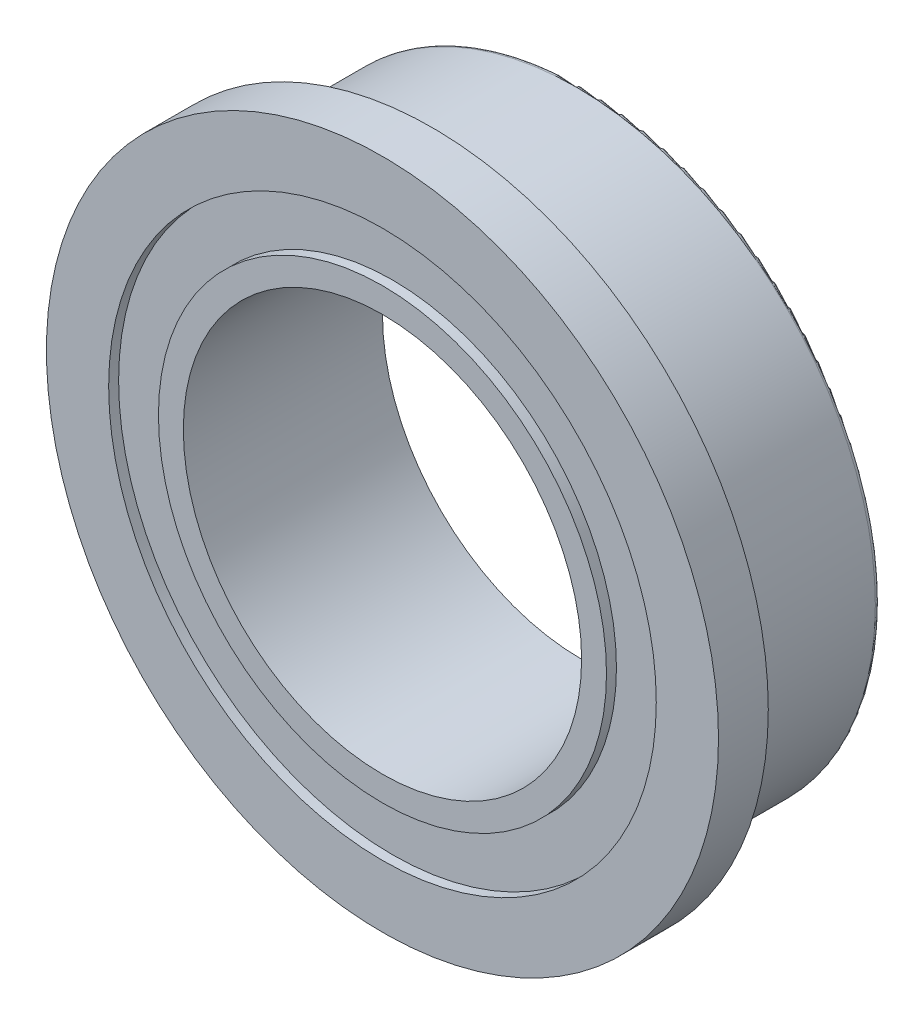
ISO-10303-21;
HEADER;
FILE_DESCRIPTION(('STEP AP214'),'2;1');
FILE_NAME('part.step','',(''),(''),'','','');
FILE_SCHEMA(('AUTOMOTIVE_DESIGN { 1 0 10303 214 1 1 1 1 }'));
ENDSEC;
DATA;
#1=APPLICATION_CONTEXT('core data for automotive mechanical design processes');
#2=APPLICATION_PROTOCOL_DEFINITION('international standard','automotive_design',2000,#1);
#3=PRODUCT_CONTEXT('',#1,'mechanical');
#4=PRODUCT('Part','Part','',(#3));
#5=PRODUCT_RELATED_PRODUCT_CATEGORY('part','',(#4));
#6=PRODUCT_DEFINITION_FORMATION('','',#4);
#7=PRODUCT_DEFINITION_CONTEXT('part definition',#1,'design');
#8=PRODUCT_DEFINITION('design','',#6,#7);
#9=PRODUCT_DEFINITION_SHAPE('','',#8);
#10=(LENGTH_UNIT() NAMED_UNIT(*) SI_UNIT(.MILLI.,.METRE.));
#11=(NAMED_UNIT(*) PLANE_ANGLE_UNIT() SI_UNIT($,.RADIAN.));
#12=(NAMED_UNIT(*) SI_UNIT($,.STERADIAN.) SOLID_ANGLE_UNIT());
#13=UNCERTAINTY_MEASURE_WITH_UNIT(LENGTH_MEASURE(1.E-05),#10,'distance_accuracy_value','');
#14=(GEOMETRIC_REPRESENTATION_CONTEXT(3) GLOBAL_UNCERTAINTY_ASSIGNED_CONTEXT((#13)) GLOBAL_UNIT_ASSIGNED_CONTEXT((#10,
#11,#12)) REPRESENTATION_CONTEXT('',''));
#15=CARTESIAN_POINT('',(0.,0.,0.));
#16=DIRECTION('',(0.,0.,1.));
#17=DIRECTION('',(1.,0.,0.));
#18=AXIS2_PLACEMENT_3D('',#15,#16,#17);
#19=CARTESIAN_POINT('',(0.,0.,4.));
#20=DIRECTION('',(0.,0.,1.));
#21=DIRECTION('',(1.,0.,0.));
#22=AXIS2_PLACEMENT_3D('',#19,#20,#21);
#23=PLANE('',#22);
#24=CARTESIAN_POINT('',(0.,0.,4.));
#25=DIRECTION('',(0.,0.,-1.));
#26=DIRECTION('',(-1.,0.,0.));
#27=AXIS2_PLACEMENT_3D('',#24,#25,#26);
#28=CIRCLE('',#27,4.);
#29=CARTESIAN_POINT('',(-4.,0.,4.));
#30=VERTEX_POINT('',#29);
#31=EDGE_CURVE('E54',#30,#30,#28,.T.);
#32=ORIENTED_EDGE('',*,*,#31,.T.);
#33=EDGE_LOOP('',(#32));
#34=FACE_BOUND('',#33,.T.);
#35=CARTESIAN_POINT('',(0.,0.,4.));
#36=DIRECTION('',(0.,0.,1.));
#37=DIRECTION('',(1.,0.,0.));
#38=AXIS2_PLACEMENT_3D('',#35,#36,#37);
#39=CIRCLE('',#38,4.5);
#40=CARTESIAN_POINT('',(4.5,0.,4.));
#41=VERTEX_POINT('',#40);
#42=EDGE_CURVE('E81',#41,#41,#39,.T.);
#43=ORIENTED_EDGE('',*,*,#42,.T.);
#44=EDGE_LOOP('',(#43));
#45=FACE_BOUND('',#44,.T.);
#46=ADVANCED_FACE('F33',(#34,#45),#23,.T.);
#47=CARTESIAN_POINT('',(0.,0.,0.));
#48=DIRECTION('',(0.,0.,1.));
#49=DIRECTION('',(1.,0.,0.));
#50=AXIS2_PLACEMENT_3D('',#47,#48,#49);
#51=PLANE('',#50);
#52=CARTESIAN_POINT('',(0.,0.,0.));
#53=DIRECTION('',(0.,0.,-1.));
#54=DIRECTION('',(-1.,0.,0.));
#55=AXIS2_PLACEMENT_3D('',#52,#53,#54);
#56=CIRCLE('',#55,4.);
#57=CARTESIAN_POINT('',(-4.,0.,0.));
#58=VERTEX_POINT('',#57);
#59=EDGE_CURVE('E57',#58,#58,#56,.T.);
#60=ORIENTED_EDGE('',*,*,#59,.F.);
#61=EDGE_LOOP('',(#60));
#62=FACE_BOUND('',#61,.T.);
#63=CARTESIAN_POINT('',(0.,0.,0.));
#64=DIRECTION('',(0.,0.,-1.));
#65=DIRECTION('',(-1.,0.,0.));
#66=AXIS2_PLACEMENT_3D('',#63,#64,#65);
#67=CIRCLE('',#66,4.5);
#68=CARTESIAN_POINT('',(-4.5,0.,0.));
#69=VERTEX_POINT('',#68);
#70=EDGE_CURVE('E69',#69,#69,#67,.T.);
#71=ORIENTED_EDGE('',*,*,#70,.T.);
#72=EDGE_LOOP('',(#71));
#73=FACE_BOUND('',#72,.T.);
#74=ADVANCED_FACE('F124',(#62,#73),#51,.F.);
#75=CARTESIAN_POINT('',(0.,0.,4.));
#76=DIRECTION('',(0.,0.,-1.));
#77=DIRECTION('',(-1.,0.,0.));
#78=AXIS2_PLACEMENT_3D('',#75,#76,#77);
#79=CYLINDRICAL_SURFACE('',#78,6.);
#80=CARTESIAN_POINT('',(0.,0.,0.0999999999999998));
#81=DIRECTION('',(0.,0.,1.));
#82=DIRECTION('',(1.,0.,0.));
#83=AXIS2_PLACEMENT_3D('',#80,#81,#82);
#84=CIRCLE('',#83,6.);
#85=CARTESIAN_POINT('',(6.,0.,0.0999999999999998));
#86=VERTEX_POINT('',#85);
#87=EDGE_CURVE('E40',#86,#86,#84,.T.);
#88=ORIENTED_EDGE('',*,*,#87,.T.);
#89=EDGE_LOOP('',(#88));
#90=FACE_BOUND('',#89,.T.);
#91=CARTESIAN_POINT('',(0.,0.,3.));
#92=DIRECTION('',(0.,0.,1.));
#93=DIRECTION('',(1.,0.,0.));
#94=AXIS2_PLACEMENT_3D('',#91,#92,#93);
#95=CIRCLE('',#94,6.);
#96=CARTESIAN_POINT('',(6.,0.,3.));
#97=VERTEX_POINT('',#96);
#98=EDGE_CURVE('E44',#97,#97,#95,.T.);
#99=ORIENTED_EDGE('',*,*,#98,.F.);
#100=EDGE_LOOP('',(#99));
#101=FACE_BOUND('',#100,.T.);
#102=ADVANCED_FACE('F122',(#90,#101),#79,.T.);
#103=CARTESIAN_POINT('',(0.,0.,0.));
#104=DIRECTION('',(0.,0.,1.));
#105=DIRECTION('',(1.,0.,0.));
#106=AXIS2_PLACEMENT_3D('',#103,#104,#105);
#107=CIRCLE('',#106,5.9);
#108=CARTESIAN_POINT('',(5.9,0.,0.));
#109=VERTEX_POINT('',#108);
#110=EDGE_CURVE('E10',#109,#109,#107,.F.);
#111=ORIENTED_EDGE('',*,*,#110,.T.);
#112=EDGE_LOOP('',(#111));
#113=FACE_BOUND('',#112,.T.);
#114=CARTESIAN_POINT('',(0.,0.,0.));
#115=DIRECTION('',(0.,0.,-1.));
#116=DIRECTION('',(-1.,0.,0.));
#117=AXIS2_PLACEMENT_3D('',#114,#115,#116);
#118=CIRCLE('',#117,5.5);
#119=CARTESIAN_POINT('',(-5.5,0.,0.));
#120=VERTEX_POINT('',#119);
#121=EDGE_CURVE('E63',#120,#120,#118,.T.);
#122=ORIENTED_EDGE('',*,*,#121,.F.);
#123=EDGE_LOOP('',(#122));
#124=FACE_BOUND('',#123,.T.);
#125=ADVANCED_FACE('F113',(#113,#124),#51,.F.);
#126=CARTESIAN_POINT('',(0.,0.,3.));
#127=DIRECTION('',(0.,0.,1.));
#128=DIRECTION('',(1.,0.,0.));
#129=AXIS2_PLACEMENT_3D('',#126,#127,#128);
#130=CYLINDRICAL_SURFACE('',#129,6.75);
#131=CARTESIAN_POINT('',(0.,0.,3.));
#132=DIRECTION('',(0.,0.,1.));
#133=DIRECTION('',(1.,0.,0.));
#134=AXIS2_PLACEMENT_3D('',#131,#132,#133);
#135=CIRCLE('',#134,6.75);
#136=CARTESIAN_POINT('',(6.75,0.,3.));
#137=VERTEX_POINT('',#136);
#138=EDGE_CURVE('E48',#137,#137,#135,.T.);
#139=ORIENTED_EDGE('',*,*,#138,.T.);
#140=EDGE_LOOP('',(#139));
#141=FACE_BOUND('',#140,.T.);
#142=CARTESIAN_POINT('',(0.,0.,4.));
#143=DIRECTION('',(0.,0.,1.));
#144=DIRECTION('',(1.,0.,0.));
#145=AXIS2_PLACEMENT_3D('',#142,#143,#144);
#146=CIRCLE('',#145,6.75);
#147=CARTESIAN_POINT('',(6.75,0.,4.));
#148=VERTEX_POINT('',#147);
#149=EDGE_CURVE('E51',#148,#148,#146,.T.);
#150=ORIENTED_EDGE('',*,*,#149,.F.);
#151=EDGE_LOOP('',(#150));
#152=FACE_BOUND('',#151,.T.);
#153=ADVANCED_FACE('F111',(#141,#152),#130,.T.);
#154=CARTESIAN_POINT('',(0.,0.,3.));
#155=DIRECTION('',(0.,0.,1.));
#156=DIRECTION('',(1.,0.,0.));
#157=AXIS2_PLACEMENT_3D('',#154,#155,#156);
#158=PLANE('',#157);
#159=ORIENTED_EDGE('',*,*,#98,.T.);
#160=EDGE_LOOP('',(#159));
#161=FACE_BOUND('',#160,.T.);
#162=ORIENTED_EDGE('',*,*,#138,.F.);
#163=EDGE_LOOP('',(#162));
#164=FACE_BOUND('',#163,.T.);
#165=ADVANCED_FACE('F107',(#161,#164),#158,.F.);
#166=CARTESIAN_POINT('',(0.,0.,4.));
#167=DIRECTION('',(0.,0.,1.));
#168=DIRECTION('',(1.,0.,0.));
#169=AXIS2_PLACEMENT_3D('',#166,#167,#168);
#170=CIRCLE('',#169,5.5);
#171=CARTESIAN_POINT('',(5.5,0.,4.));
#172=VERTEX_POINT('',#171);
#173=EDGE_CURVE('E75',#172,#172,#170,.T.);
#174=ORIENTED_EDGE('',*,*,#173,.F.);
#175=EDGE_LOOP('',(#174));
#176=FACE_BOUND('',#175,.T.);
#177=ORIENTED_EDGE('',*,*,#149,.T.);
#178=EDGE_LOOP('',(#177));
#179=FACE_BOUND('',#178,.T.);
#180=ADVANCED_FACE('F103',(#176,#179),#23,.T.);
#181=CARTESIAN_POINT('',(0.,0.,4.));
#182=DIRECTION('',(0.,0.,-1.));
#183=DIRECTION('',(-1.,0.,0.));
#184=AXIS2_PLACEMENT_3D('',#181,#182,#183);
#185=CYLINDRICAL_SURFACE('',#184,4.);
#186=ORIENTED_EDGE('',*,*,#31,.F.);
#187=EDGE_LOOP('',(#186));
#188=FACE_BOUND('',#187,.T.);
#189=ORIENTED_EDGE('',*,*,#59,.T.);
#190=EDGE_LOOP('',(#189));
#191=FACE_BOUND('',#190,.T.);
#192=ADVANCED_FACE('F106',(#188,#191),#185,.F.);
#193=CARTESIAN_POINT('',(0.,0.,0.2));
#194=DIRECTION('',(0.,0.,-1.));
#195=DIRECTION('',(-1.,0.,0.));
#196=AXIS2_PLACEMENT_3D('',#193,#194,#195);
#197=CYLINDRICAL_SURFACE('',#196,5.5);
#198=CARTESIAN_POINT('',(0.,0.,0.2));
#199=DIRECTION('',(0.,0.,-1.));
#200=DIRECTION('',(-1.,0.,0.));
#201=AXIS2_PLACEMENT_3D('',#198,#199,#200);
#202=CIRCLE('',#201,5.5);
#203=CARTESIAN_POINT('',(-5.5,0.,0.2));
#204=VERTEX_POINT('',#203);
#205=EDGE_CURVE('E60',#204,#204,#202,.T.);
#206=ORIENTED_EDGE('',*,*,#205,.F.);
#207=EDGE_LOOP('',(#206));
#208=FACE_BOUND('',#207,.T.);
#209=ORIENTED_EDGE('',*,*,#121,.T.);
#210=EDGE_LOOP('',(#209));
#211=FACE_BOUND('',#210,.T.);
#212=ADVANCED_FACE('F186',(#208,#211),#197,.F.);
#213=CARTESIAN_POINT('',(0.,0.,0.2));
#214=DIRECTION('',(0.,0.,-1.));
#215=DIRECTION('',(-1.,0.,0.));
#216=AXIS2_PLACEMENT_3D('',#213,#214,#215);
#217=PLANE('',#216);
#218=CARTESIAN_POINT('',(0.,0.,0.2));
#219=DIRECTION('',(0.,0.,-1.));
#220=DIRECTION('',(-1.,0.,0.));
#221=AXIS2_PLACEMENT_3D('',#218,#219,#220);
#222=CIRCLE('',#221,4.5);
#223=CARTESIAN_POINT('',(-4.5,0.,0.2));
#224=VERTEX_POINT('',#223);
#225=EDGE_CURVE('E66',#224,#224,#222,.T.);
#226=ORIENTED_EDGE('',*,*,#225,.F.);
#227=EDGE_LOOP('',(#226));
#228=FACE_BOUND('',#227,.T.);
#229=ORIENTED_EDGE('',*,*,#205,.T.);
#230=EDGE_LOOP('',(#229));
#231=FACE_BOUND('',#230,.T.);
#232=ADVANCED_FACE('F178',(#228,#231),#217,.T.);
#233=CARTESIAN_POINT('',(0.,0.,0.2));
#234=DIRECTION('',(0.,0.,-1.));
#235=DIRECTION('',(-1.,0.,0.));
#236=AXIS2_PLACEMENT_3D('',#233,#234,#235);
#237=CYLINDRICAL_SURFACE('',#236,4.5);
#238=ORIENTED_EDGE('',*,*,#225,.T.);
#239=EDGE_LOOP('',(#238));
#240=FACE_BOUND('',#239,.T.);
#241=ORIENTED_EDGE('',*,*,#70,.F.);
#242=EDGE_LOOP('',(#241));
#243=FACE_BOUND('',#242,.T.);
#244=ADVANCED_FACE('F99',(#240,#243),#237,.T.);
#245=CARTESIAN_POINT('',(0.,0.,3.8));
#246=DIRECTION('',(0.,0.,1.));
#247=DIRECTION('',(1.,0.,0.));
#248=AXIS2_PLACEMENT_3D('',#245,#246,#247);
#249=CYLINDRICAL_SURFACE('',#248,5.5);
#250=CARTESIAN_POINT('',(0.,0.,3.8));
#251=DIRECTION('',(0.,0.,1.));
#252=DIRECTION('',(1.,0.,0.));
#253=AXIS2_PLACEMENT_3D('',#250,#251,#252);
#254=CIRCLE('',#253,5.5);
#255=CARTESIAN_POINT('',(5.5,0.,3.8));
#256=VERTEX_POINT('',#255);
#257=EDGE_CURVE('E72',#256,#256,#254,.T.);
#258=ORIENTED_EDGE('',*,*,#257,.F.);
#259=EDGE_LOOP('',(#258));
#260=FACE_BOUND('',#259,.T.);
#261=ORIENTED_EDGE('',*,*,#173,.T.);
#262=EDGE_LOOP('',(#261));
#263=FACE_BOUND('',#262,.T.);
#264=ADVANCED_FACE('F93',(#260,#263),#249,.F.);
#265=CARTESIAN_POINT('',(0.,0.,3.8));
#266=DIRECTION('',(0.,0.,1.));
#267=DIRECTION('',(1.,0.,0.));
#268=AXIS2_PLACEMENT_3D('',#265,#266,#267);
#269=PLANE('',#268);
#270=CARTESIAN_POINT('',(0.,0.,3.8));
#271=DIRECTION('',(0.,0.,1.));
#272=DIRECTION('',(1.,0.,0.));
#273=AXIS2_PLACEMENT_3D('',#270,#271,#272);
#274=CIRCLE('',#273,4.5);
#275=CARTESIAN_POINT('',(4.5,0.,3.8));
#276=VERTEX_POINT('',#275);
#277=EDGE_CURVE('E78',#276,#276,#274,.T.);
#278=ORIENTED_EDGE('',*,*,#277,.F.);
#279=EDGE_LOOP('',(#278));
#280=FACE_BOUND('',#279,.T.);
#281=ORIENTED_EDGE('',*,*,#257,.T.);
#282=EDGE_LOOP('',(#281));
#283=FACE_BOUND('',#282,.T.);
#284=ADVANCED_FACE('F90',(#280,#283),#269,.T.);
#285=CARTESIAN_POINT('',(0.,0.,3.8));
#286=DIRECTION('',(0.,0.,1.));
#287=DIRECTION('',(1.,0.,0.));
#288=AXIS2_PLACEMENT_3D('',#285,#286,#287);
#289=CYLINDRICAL_SURFACE('',#288,4.5);
#290=ORIENTED_EDGE('',*,*,#277,.T.);
#291=EDGE_LOOP('',(#290));
#292=FACE_BOUND('',#291,.T.);
#293=ORIENTED_EDGE('',*,*,#42,.F.);
#294=EDGE_LOOP('',(#293));
#295=FACE_BOUND('',#294,.T.);
#296=ADVANCED_FACE('F87',(#292,#295),#289,.T.);
#297=CARTESIAN_POINT('',(0.,0.,0.0999999999999998));
#298=DIRECTION('',(0.,0.,1.));
#299=DIRECTION('',(1.,0.,0.));
#300=AXIS2_PLACEMENT_3D('',#297,#298,#299);
#301=TOROIDAL_SURFACE('',#300,5.9,0.1);
#302=ORIENTED_EDGE('',*,*,#110,.F.);
#303=EDGE_LOOP('',(#302));
#304=FACE_BOUND('',#303,.T.);
#305=ORIENTED_EDGE('',*,*,#87,.F.);
#306=EDGE_LOOP('',(#305));
#307=FACE_BOUND('',#306,.T.);
#308=ADVANCED_FACE('F35',(#304,#307),#301,.T.);
#309=CLOSED_SHELL('',(#46,#74,#102,#125,#153,#165,#180,#192,#212,#232,#244,#264,#284,#296,#308));
#310=MANIFOLD_SOLID_BREP('B2',#309);
#311=ADVANCED_BREP_SHAPE_REPRESENTATION('',(#18,#310),#14);
#312=SHAPE_DEFINITION_REPRESENTATION(#9,#311);
ENDSEC;
END-ISO-10303-21;
